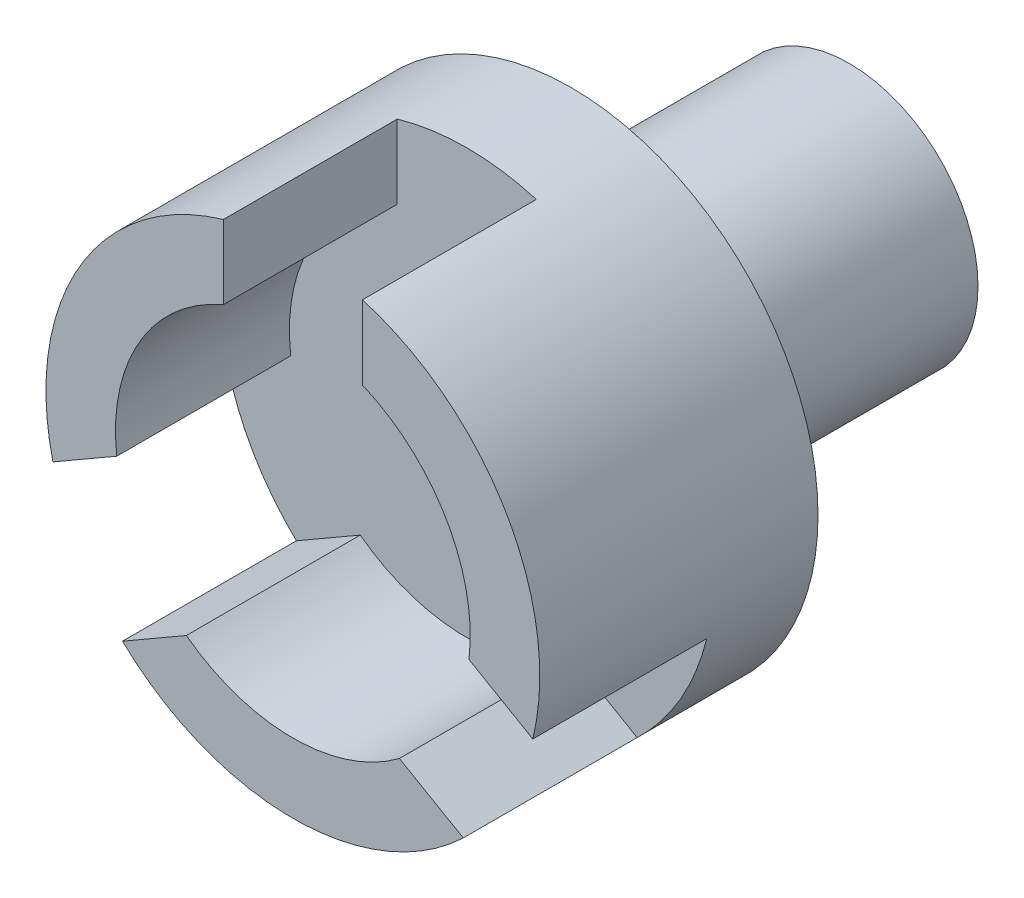
ISO-10303-21;
HEADER;
FILE_DESCRIPTION(('STEP AP214'),'2;1');
FILE_NAME('part.step','',(''),(''),'','','');
FILE_SCHEMA(('AUTOMOTIVE_DESIGN { 1 0 10303 214 1 1 1 1 }'));
ENDSEC;
DATA;
#1=APPLICATION_CONTEXT('core data for automotive mechanical design processes');
#2=APPLICATION_PROTOCOL_DEFINITION('international standard','automotive_design',2000,#1);
#3=PRODUCT_CONTEXT('',#1,'mechanical');
#4=PRODUCT('Part','Part','',(#3));
#5=PRODUCT_RELATED_PRODUCT_CATEGORY('part','',(#4));
#6=PRODUCT_DEFINITION_FORMATION('','',#4);
#7=PRODUCT_DEFINITION_CONTEXT('part definition',#1,'design');
#8=PRODUCT_DEFINITION('design','',#6,#7);
#9=PRODUCT_DEFINITION_SHAPE('','',#8);
#10=(LENGTH_UNIT() NAMED_UNIT(*) SI_UNIT(.MILLI.,.METRE.));
#11=(NAMED_UNIT(*) PLANE_ANGLE_UNIT() SI_UNIT($,.RADIAN.));
#12=(NAMED_UNIT(*) SI_UNIT($,.STERADIAN.) SOLID_ANGLE_UNIT());
#13=UNCERTAINTY_MEASURE_WITH_UNIT(LENGTH_MEASURE(1.E-05),#10,'distance_accuracy_value','');
#14=(GEOMETRIC_REPRESENTATION_CONTEXT(3) GLOBAL_UNCERTAINTY_ASSIGNED_CONTEXT((#13)) GLOBAL_UNIT_ASSIGNED_CONTEXT((#10,
#11,#12)) REPRESENTATION_CONTEXT('',''));
#15=CARTESIAN_POINT('',(0.,0.,0.));
#16=DIRECTION('',(0.,0.,1.));
#17=DIRECTION('',(1.,0.,0.));
#18=AXIS2_PLACEMENT_3D('',#15,#16,#17);
#19=CARTESIAN_POINT('',(-2.76322328200395,3.5645580337851,8.));
#20=DIRECTION('',(0.,0.,-1.));
#21=DIRECTION('',(-1.,0.,0.));
#22=AXIS2_PLACEMENT_3D('',#19,#20,#21);
#23=CYLINDRICAL_SURFACE('',#22,7.1);
#24=CARTESIAN_POINT('',(-2.76322328200395,3.5645580337851,0.));
#25=DIRECTION('',(0.,0.,1.));
#26=DIRECTION('',(1.,0.,0.));
#27=AXIS2_PLACEMENT_3D('',#24,#25,#26);
#28=CIRCLE('',#27,7.1);
#29=CARTESIAN_POINT('',(4.33677671799605,3.5645580337851,0.));
#30=VERTEX_POINT('',#29);
#31=EDGE_CURVE('E257',#30,#30,#28,.T.);
#32=ORIENTED_EDGE('',*,*,#31,.T.);
#33=EDGE_LOOP('',(#32));
#34=FACE_BOUND('',#33,.T.);
#35=DIRECTION('',(0.,0.,1.));
#36=VECTOR('',#35,1.);
#37=CARTESIAN_POINT('',(-4.76322328200395,10.3770465658855,3.));
#38=LINE('',#37,#36);
#39=CARTESIAN_POINT('',(-4.76322328200395,10.3770465658855,3.));
#40=VERTEX_POINT('',#39);
#41=CARTESIAN_POINT('',(-4.76322328200395,10.3770465658855,8.));
#42=VERTEX_POINT('',#41);
#43=EDGE_CURVE('E226',#40,#42,#38,.T.);
#44=ORIENTED_EDGE('',*,*,#43,.F.);
#45=CARTESIAN_POINT('',(-2.76322328200395,3.5645580337851,3.));
#46=DIRECTION('',(0.,0.,1.));
#47=DIRECTION('',(1.,0.,0.));
#48=AXIS2_PLACEMENT_3D('',#45,#46,#47);
#49=CIRCLE('',#48,7.1);
#50=CARTESIAN_POINT('',(-0.763223282003949,10.3770465658855,3.));
#51=VERTEX_POINT('',#50);
#52=EDGE_CURVE('E184',#51,#40,#49,.T.);
#53=ORIENTED_EDGE('',*,*,#52,.F.);
#54=DIRECTION('',(0.,0.,1.));
#55=VECTOR('',#54,1.);
#56=CARTESIAN_POINT('',(-0.763223282003949,10.3770465658855,3.));
#57=LINE('',#56,#55);
#58=CARTESIAN_POINT('',(-0.763223282003949,10.3770465658855,8.));
#59=VERTEX_POINT('',#58);
#60=EDGE_CURVE('E229',#51,#59,#57,.T.);
#61=ORIENTED_EDGE('',*,*,#60,.T.);
#62=CARTESIAN_POINT('',(-2.76322328200395,3.5645580337851,8.));
#63=DIRECTION('',(0.,0.,1.));
#64=DIRECTION('',(1.,0.,0.));
#65=AXIS2_PLACEMENT_3D('',#62,#63,#64);
#66=CIRCLE('',#65,7.1);
#67=CARTESIAN_POINT('',(4.13656484978518,1.89036457530373,8.));
#68=VERTEX_POINT('',#67);
#69=EDGE_CURVE('E252',#68,#59,#66,.T.);
#70=ORIENTED_EDGE('',*,*,#69,.F.);
#71=DIRECTION('',(0.,0.,1.));
#72=VECTOR('',#71,1.);
#73=CARTESIAN_POINT('',(4.13656484978518,1.89036457530373,3.));
#74=LINE('',#73,#72);
#75=CARTESIAN_POINT('',(4.13656484978518,1.89036457530373,3.));
#76=VERTEX_POINT('',#75);
#77=EDGE_CURVE('E172',#76,#68,#74,.T.);
#78=ORIENTED_EDGE('',*,*,#77,.F.);
#79=CARTESIAN_POINT('',(-2.76322328200395,3.5645580337851,3.));
#80=DIRECTION('',(0.,0.,1.));
#81=DIRECTION('',(1.,0.,0.));
#82=AXIS2_PLACEMENT_3D('',#79,#80,#81);
#83=CIRCLE('',#82,7.1);
#84=CARTESIAN_POINT('',(2.13656484978517,-1.57373703983402,3.));
#85=VERTEX_POINT('',#84);
#86=EDGE_CURVE('E155',#85,#76,#83,.T.);
#87=ORIENTED_EDGE('',*,*,#86,.F.);
#88=DIRECTION('',(0.,0.,1.));
#89=VECTOR('',#88,1.);
#90=CARTESIAN_POINT('',(2.13656484978517,-1.57373703983402,3.));
#91=LINE('',#90,#89);
#92=CARTESIAN_POINT('',(2.13656484978517,-1.57373703983402,8.));
#93=VERTEX_POINT('',#92);
#94=EDGE_CURVE('E164',#85,#93,#91,.T.);
#95=ORIENTED_EDGE('',*,*,#94,.T.);
#96=CARTESIAN_POINT('',(-7.66301141379314,-1.57373703983395,8.));
#97=VERTEX_POINT('',#96);
#98=EDGE_CURVE('E256',#97,#93,#66,.T.);
#99=ORIENTED_EDGE('',*,*,#98,.F.);
#100=DIRECTION('',(0.,0.,1.));
#101=VECTOR('',#100,1.);
#102=CARTESIAN_POINT('',(-7.66301141379314,-1.57373703983395,3.));
#103=LINE('',#102,#101);
#104=CARTESIAN_POINT('',(-7.66301141379314,-1.57373703983395,3.));
#105=VERTEX_POINT('',#104);
#106=EDGE_CURVE('E218',#105,#97,#103,.T.);
#107=ORIENTED_EDGE('',*,*,#106,.F.);
#108=CARTESIAN_POINT('',(-2.76322328200395,3.5645580337851,3.));
#109=DIRECTION('',(0.,0.,1.));
#110=DIRECTION('',(1.,0.,0.));
#111=AXIS2_PLACEMENT_3D('',#108,#109,#110);
#112=CIRCLE('',#111,7.1);
#113=CARTESIAN_POINT('',(-9.6630114137931,1.89036457530383,3.));
#114=VERTEX_POINT('',#113);
#115=EDGE_CURVE('E194',#114,#105,#112,.T.);
#116=ORIENTED_EDGE('',*,*,#115,.F.);
#117=DIRECTION('',(0.,0.,1.));
#118=VECTOR('',#117,1.);
#119=CARTESIAN_POINT('',(-9.6630114137931,1.89036457530383,3.));
#120=LINE('',#119,#118);
#121=CARTESIAN_POINT('',(-9.6630114137931,1.89036457530383,8.));
#122=VERTEX_POINT('',#121);
#123=EDGE_CURVE('E222',#114,#122,#120,.T.);
#124=ORIENTED_EDGE('',*,*,#123,.T.);
#125=EDGE_CURVE('E258',#42,#122,#66,.T.);
#126=ORIENTED_EDGE('',*,*,#125,.F.);
#127=EDGE_LOOP('',(#44,#53,#61,#70,#78,#87,#95,#99,#107,#116,#124,#126));
#128=FACE_BOUND('',#127,.T.);
#129=ADVANCED_FACE('F63',(#34,#128),#23,.T.);
#130=CARTESIAN_POINT('',(-2.76322328200395,3.5645580337851,8.));
#131=DIRECTION('',(0.,0.,1.));
#132=DIRECTION('',(1.,0.,0.));
#133=AXIS2_PLACEMENT_3D('',#130,#131,#132);
#134=PLANE('',#133);
#135=DIRECTION('',(0.866025403784436,-0.500000000000004,0.));
#136=VECTOR('',#135,1.);
#137=CARTESIAN_POINT('',(-2.76322328200396,1.2551569570266,8.));
#138=LINE('',#137,#136);
#139=CARTESIAN_POINT('',(0.299719001612672,-0.513233594931769,8.));
#140=VERTEX_POINT('',#139);
#141=EDGE_CURVE('E167',#140,#93,#138,.T.);
#142=ORIENTED_EDGE('',*,*,#141,.F.);
#143=CARTESIAN_POINT('',(-2.76322328200395,3.5645580337851,8.));
#144=DIRECTION('',(0.,0.,1.));
#145=DIRECTION('',(1.,0.,0.));
#146=AXIS2_PLACEMENT_3D('',#143,#144,#145);
#147=CIRCLE('',#146,5.1);
#148=CARTESIAN_POINT('',(-5.82616556562063,-0.513233594931728,8.));
#149=VERTEX_POINT('',#148);
#150=EDGE_CURVE('E251',#149,#140,#147,.T.);
#151=ORIENTED_EDGE('',*,*,#150,.F.);
#152=DIRECTION('',(-0.866025403784443,-0.499999999999992,0.));
#153=VECTOR('',#152,1.);
#154=CARTESIAN_POINT('',(-2.76322328200396,1.2551569570266,8.));
#155=LINE('',#154,#153);
#156=EDGE_CURVE('E161',#149,#97,#155,.T.);
#157=ORIENTED_EDGE('',*,*,#156,.T.);
#158=ORIENTED_EDGE('',*,*,#98,.T.);
#159=EDGE_LOOP('',(#142,#151,#157,#158));
#160=FACE_BOUND('',#159,.T.);
#161=ADVANCED_FACE('F312',(#160),#134,.T.);
#162=DIRECTION('',(-0.866025403784443,-0.499999999999992,0.));
#163=VECTOR('',#162,1.);
#164=CARTESIAN_POINT('',(-4.76322328200395,4.71925857216437,8.));
#165=LINE('',#164,#163);
#166=CARTESIAN_POINT('',(-7.82616556562059,2.95086802020605,8.));
#167=VERTEX_POINT('',#166);
#168=EDGE_CURVE('E212',#167,#122,#165,.T.);
#169=ORIENTED_EDGE('',*,*,#168,.F.);
#170=CARTESIAN_POINT('',(-4.76322328200395,8.25603967608106,8.));
#171=VERTEX_POINT('',#170);
#172=EDGE_CURVE('E246',#171,#167,#147,.T.);
#173=ORIENTED_EDGE('',*,*,#172,.F.);
#174=DIRECTION('',(0.,1.,0.));
#175=VECTOR('',#174,1.);
#176=CARTESIAN_POINT('',(-4.76322328200395,4.71925857216437,8.));
#177=LINE('',#176,#175);
#178=EDGE_CURVE('E208',#171,#42,#177,.T.);
#179=ORIENTED_EDGE('',*,*,#178,.T.);
#180=ORIENTED_EDGE('',*,*,#125,.T.);
#181=EDGE_LOOP('',(#169,#173,#179,#180));
#182=FACE_BOUND('',#181,.T.);
#183=ADVANCED_FACE('F307',(#182),#134,.T.);
#184=CARTESIAN_POINT('',(-2.76322328200395,3.5645580337851,3.));
#185=DIRECTION('',(0.,0.,1.));
#186=DIRECTION('',(1.,0.,0.));
#187=AXIS2_PLACEMENT_3D('',#184,#185,#186);
#188=CYLINDRICAL_SURFACE('',#187,5.1);
#189=ORIENTED_EDGE('',*,*,#150,.T.);
#190=DIRECTION('',(0.,0.,1.));
#191=VECTOR('',#190,1.);
#192=CARTESIAN_POINT('',(0.299719001612672,-0.513233594931769,3.));
#193=LINE('',#192,#191);
#194=CARTESIAN_POINT('',(0.299719001612672,-0.513233594931769,3.));
#195=VERTEX_POINT('',#194);
#196=EDGE_CURVE('E12',#140,#195,#193,.F.);
#197=ORIENTED_EDGE('',*,*,#196,.T.);
#198=CARTESIAN_POINT('',(-2.76322328200395,3.5645580337851,3.));
#199=DIRECTION('',(0.,0.,1.));
#200=DIRECTION('',(1.,0.,0.));
#201=AXIS2_PLACEMENT_3D('',#198,#199,#200);
#202=CIRCLE('',#201,5.1);
#203=CARTESIAN_POINT('',(-5.82616556562062,-0.513233594931727,3.));
#204=VERTEX_POINT('',#203);
#205=EDGE_CURVE('E158',#204,#195,#202,.T.);
#206=ORIENTED_EDGE('',*,*,#205,.F.);
#207=DIRECTION('',(0.,0.,1.));
#208=VECTOR('',#207,1.);
#209=CARTESIAN_POINT('',(-5.82616556562063,-0.513233594931727,3.));
#210=LINE('',#209,#208);
#211=EDGE_CURVE('E71',#149,#204,#210,.F.);
#212=ORIENTED_EDGE('',*,*,#211,.F.);
#213=EDGE_LOOP('',(#189,#197,#206,#212));
#214=FACE_BOUND('',#213,.T.);
#215=ADVANCED_FACE('F291',(#214),#188,.F.);
#216=ORIENTED_EDGE('',*,*,#172,.T.);
#217=DIRECTION('',(0.,0.,1.));
#218=VECTOR('',#217,1.);
#219=CARTESIAN_POINT('',(-7.82616556562059,2.95086802020605,3.));
#220=LINE('',#219,#218);
#221=CARTESIAN_POINT('',(-7.82616556562059,2.95086802020605,3.));
#222=VERTEX_POINT('',#221);
#223=EDGE_CURVE('E281',#167,#222,#220,.F.);
#224=ORIENTED_EDGE('',*,*,#223,.T.);
#225=CARTESIAN_POINT('',(-4.76322328200395,8.25603967608106,3.));
#226=VERTEX_POINT('',#225);
#227=EDGE_CURVE('E247',#226,#222,#202,.T.);
#228=ORIENTED_EDGE('',*,*,#227,.F.);
#229=DIRECTION('',(0.,0.,1.));
#230=VECTOR('',#229,1.);
#231=CARTESIAN_POINT('',(-4.76322328200395,8.25603967608106,3.));
#232=LINE('',#231,#230);
#233=EDGE_CURVE('E277',#171,#226,#232,.F.);
#234=ORIENTED_EDGE('',*,*,#233,.F.);
#235=EDGE_LOOP('',(#216,#224,#228,#234));
#236=FACE_BOUND('',#235,.T.);
#237=ADVANCED_FACE('F300',(#236),#188,.F.);
#238=CARTESIAN_POINT('',(-2.76322328200395,3.5645580337851,6.));
#239=DIRECTION('',(0.,0.,-1.));
#240=DIRECTION('',(-1.,0.,0.));
#241=AXIS2_PLACEMENT_3D('',#238,#239,#240);
#242=CYLINDRICAL_SURFACE('',#241,1.7);
#243=CARTESIAN_POINT('',(-2.76322328200395,3.5645580337851,3.));
#244=DIRECTION('',(0.,0.,1.));
#245=DIRECTION('',(1.,0.,0.));
#246=AXIS2_PLACEMENT_3D('',#243,#244,#245);
#247=CIRCLE('',#246,1.7);
#248=CARTESIAN_POINT('',(-1.06322328200395,3.5645580337851,3.));
#249=VERTEX_POINT('',#248);
#250=EDGE_CURVE('E262',#249,#249,#247,.F.);
#251=ORIENTED_EDGE('',*,*,#250,.F.);
#252=EDGE_LOOP('',(#251));
#253=FACE_BOUND('',#252,.T.);
#254=CARTESIAN_POINT('',(-2.76322328200395,3.5645580337851,-8.));
#255=DIRECTION('',(0.,0.,-1.));
#256=DIRECTION('',(-1.,0.,0.));
#257=AXIS2_PLACEMENT_3D('',#254,#255,#256);
#258=CIRCLE('',#257,1.7);
#259=CARTESIAN_POINT('',(-4.46322328200395,3.5645580337851,-8.));
#260=VERTEX_POINT('',#259);
#261=EDGE_CURVE('E221',#260,#260,#258,.F.);
#262=ORIENTED_EDGE('',*,*,#261,.F.);
#263=EDGE_LOOP('',(#262));
#264=FACE_BOUND('',#263,.T.);
#265=ADVANCED_FACE('F328',(#253,#264),#242,.F.);
#266=DIRECTION('',(0.,1.,0.));
#267=VECTOR('',#266,1.);
#268=CARTESIAN_POINT('',(-0.763223282003948,4.71925857216435,8.));
#269=LINE('',#268,#267);
#270=CARTESIAN_POINT('',(-0.763223282003948,8.25603967608106,8.));
#271=VERTEX_POINT('',#270);
#272=EDGE_CURVE('E205',#271,#59,#269,.T.);
#273=ORIENTED_EDGE('',*,*,#272,.F.);
#274=CARTESIAN_POINT('',(2.29971900161269,2.95086802020598,8.));
#275=VERTEX_POINT('',#274);
#276=EDGE_CURVE('E242',#275,#271,#147,.T.);
#277=ORIENTED_EDGE('',*,*,#276,.F.);
#278=DIRECTION('',(0.866025403784436,-0.500000000000004,0.));
#279=VECTOR('',#278,1.);
#280=CARTESIAN_POINT('',(-0.763223282003948,4.71925857216435,8.));
#281=LINE('',#280,#279);
#282=EDGE_CURVE('E201',#275,#68,#281,.T.);
#283=ORIENTED_EDGE('',*,*,#282,.T.);
#284=ORIENTED_EDGE('',*,*,#69,.T.);
#285=EDGE_LOOP('',(#273,#277,#283,#284));
#286=FACE_BOUND('',#285,.T.);
#287=ADVANCED_FACE('F319',(#286),#134,.T.);
#288=CARTESIAN_POINT('',(-2.76322328200395,3.5645580337851,0.));
#289=DIRECTION('',(0.,0.,1.));
#290=DIRECTION('',(1.,0.,0.));
#291=AXIS2_PLACEMENT_3D('',#288,#289,#290);
#292=PLANE('',#291);
#293=CARTESIAN_POINT('',(-2.76322328200395,3.5645580337851,0.));
#294=DIRECTION('',(0.,0.,1.));
#295=DIRECTION('',(1.,0.,0.));
#296=AXIS2_PLACEMENT_3D('',#293,#294,#295);
#297=CIRCLE('',#296,3.7);
#298=CARTESIAN_POINT('',(0.936776717996052,3.5645580337851,0.));
#299=VERTEX_POINT('',#298);
#300=EDGE_CURVE('E266',#299,#299,#297,.F.);
#301=ORIENTED_EDGE('',*,*,#300,.F.);
#302=EDGE_LOOP('',(#301));
#303=FACE_BOUND('',#302,.T.);
#304=ORIENTED_EDGE('',*,*,#31,.F.);
#305=EDGE_LOOP('',(#304));
#306=FACE_BOUND('',#305,.T.);
#307=ADVANCED_FACE('F327',(#303,#306),#292,.F.);
#308=CARTESIAN_POINT('',(-2.76322328200395,3.5645580337851,3.));
#309=DIRECTION('',(0.,0.,1.));
#310=DIRECTION('',(1.,0.,0.));
#311=AXIS2_PLACEMENT_3D('',#308,#309,#310);
#312=PLANE('',#311);
#313=ORIENTED_EDGE('',*,*,#205,.T.);
#314=DIRECTION('',(0.866025403784436,-0.500000000000004,0.));
#315=VECTOR('',#314,1.);
#316=CARTESIAN_POINT('',(-2.76322328200396,1.2551569570266,3.));
#317=LINE('',#316,#315);
#318=EDGE_CURVE('E150',#195,#85,#317,.T.);
#319=ORIENTED_EDGE('',*,*,#318,.T.);
#320=ORIENTED_EDGE('',*,*,#86,.T.);
#321=DIRECTION('',(0.866025403784436,-0.500000000000004,0.));
#322=VECTOR('',#321,1.);
#323=CARTESIAN_POINT('',(-0.763223282003948,4.71925857216435,3.));
#324=LINE('',#323,#322);
#325=CARTESIAN_POINT('',(2.29971900161269,2.95086802020598,3.));
#326=VERTEX_POINT('',#325);
#327=EDGE_CURVE('E78',#326,#76,#324,.T.);
#328=ORIENTED_EDGE('',*,*,#327,.F.);
#329=CARTESIAN_POINT('',(-0.763223282003948,8.25603967608106,3.));
#330=VERTEX_POINT('',#329);
#331=EDGE_CURVE('E243',#326,#330,#202,.T.);
#332=ORIENTED_EDGE('',*,*,#331,.T.);
#333=DIRECTION('',(0.,1.,0.));
#334=VECTOR('',#333,1.);
#335=CARTESIAN_POINT('',(-0.763223282003948,4.71925857216435,3.));
#336=LINE('',#335,#334);
#337=EDGE_CURVE('E179',#330,#51,#336,.T.);
#338=ORIENTED_EDGE('',*,*,#337,.T.);
#339=ORIENTED_EDGE('',*,*,#52,.T.);
#340=DIRECTION('',(0.,1.,0.));
#341=VECTOR('',#340,1.);
#342=CARTESIAN_POINT('',(-4.76322328200395,4.71925857216437,3.));
#343=LINE('',#342,#341);
#344=EDGE_CURVE('E188',#226,#40,#343,.T.);
#345=ORIENTED_EDGE('',*,*,#344,.F.);
#346=ORIENTED_EDGE('',*,*,#227,.T.);
#347=DIRECTION('',(-0.866025403784443,-0.499999999999992,0.));
#348=VECTOR('',#347,1.);
#349=CARTESIAN_POINT('',(-4.76322328200395,4.71925857216437,3.));
#350=LINE('',#349,#348);
#351=EDGE_CURVE('E191',#222,#114,#350,.T.);
#352=ORIENTED_EDGE('',*,*,#351,.T.);
#353=ORIENTED_EDGE('',*,*,#115,.T.);
#354=DIRECTION('',(-0.866025403784443,-0.499999999999992,0.));
#355=VECTOR('',#354,1.);
#356=CARTESIAN_POINT('',(-2.76322328200396,1.2551569570266,3.));
#357=LINE('',#356,#355);
#358=EDGE_CURVE('E85',#204,#105,#357,.T.);
#359=ORIENTED_EDGE('',*,*,#358,.F.);
#360=EDGE_LOOP('',(#313,#319,#320,#328,#332,#338,#339,#345,#346,#352,#353,#359));
#361=FACE_BOUND('',#360,.T.);
#362=ORIENTED_EDGE('',*,*,#250,.T.);
#363=EDGE_LOOP('',(#362));
#364=FACE_BOUND('',#363,.T.);
#365=ADVANCED_FACE('F152',(#361,#364),#312,.T.);
#366=ORIENTED_EDGE('',*,*,#276,.T.);
#367=DIRECTION('',(0.,0.,1.));
#368=VECTOR('',#367,1.);
#369=CARTESIAN_POINT('',(-0.763223282003948,8.25603967608106,3.));
#370=LINE('',#369,#368);
#371=EDGE_CURVE('E273',#271,#330,#370,.F.);
#372=ORIENTED_EDGE('',*,*,#371,.T.);
#373=ORIENTED_EDGE('',*,*,#331,.F.);
#374=DIRECTION('',(0.,0.,1.));
#375=VECTOR('',#374,1.);
#376=CARTESIAN_POINT('',(2.29971900161269,2.95086802020598,3.));
#377=LINE('',#376,#375);
#378=EDGE_CURVE('E270',#275,#326,#377,.F.);
#379=ORIENTED_EDGE('',*,*,#378,.F.);
#380=EDGE_LOOP('',(#366,#372,#373,#379));
#381=FACE_BOUND('',#380,.T.);
#382=ADVANCED_FACE('F342',(#381),#188,.F.);
#383=CARTESIAN_POINT('',(-2.76322328200395,3.5645580337851,-8.));
#384=DIRECTION('',(0.,0.,1.));
#385=DIRECTION('',(1.,0.,0.));
#386=AXIS2_PLACEMENT_3D('',#383,#384,#385);
#387=CYLINDRICAL_SURFACE('',#386,3.7);
#388=CARTESIAN_POINT('',(-2.76322328200395,3.5645580337851,-8.));
#389=DIRECTION('',(0.,0.,-1.));
#390=DIRECTION('',(-1.,0.,0.));
#391=AXIS2_PLACEMENT_3D('',#388,#389,#390);
#392=CIRCLE('',#391,3.7);
#393=CARTESIAN_POINT('',(-6.46322328200395,3.5645580337851,-8.));
#394=VERTEX_POINT('',#393);
#395=EDGE_CURVE('E238',#394,#394,#392,.T.);
#396=ORIENTED_EDGE('',*,*,#395,.F.);
#397=EDGE_LOOP('',(#396));
#398=FACE_BOUND('',#397,.T.);
#399=ORIENTED_EDGE('',*,*,#300,.T.);
#400=EDGE_LOOP('',(#399));
#401=FACE_BOUND('',#400,.T.);
#402=ADVANCED_FACE('F367',(#398,#401),#387,.T.);
#403=CARTESIAN_POINT('',(0.,0.,-8.));
#404=DIRECTION('',(0.,0.,-1.));
#405=DIRECTION('',(-1.,0.,0.));
#406=AXIS2_PLACEMENT_3D('',#403,#404,#405);
#407=PLANE('',#406);
#408=ORIENTED_EDGE('',*,*,#261,.T.);
#409=EDGE_LOOP('',(#408));
#410=FACE_BOUND('',#409,.T.);
#411=ORIENTED_EDGE('',*,*,#395,.T.);
#412=EDGE_LOOP('',(#411));
#413=FACE_BOUND('',#412,.T.);
#414=ADVANCED_FACE('F357',(#410,#413),#407,.T.);
#415=CARTESIAN_POINT('',(-0.763223282003948,4.71925857216435,3.));
#416=DIRECTION('',(1.,0.,0.));
#417=DIRECTION('',(0.,1.,0.));
#418=AXIS2_PLACEMENT_3D('',#415,#416,#417);
#419=PLANE('',#418);
#420=ORIENTED_EDGE('',*,*,#272,.T.);
#421=ORIENTED_EDGE('',*,*,#60,.F.);
#422=ORIENTED_EDGE('',*,*,#337,.F.);
#423=ORIENTED_EDGE('',*,*,#371,.F.);
#424=EDGE_LOOP('',(#420,#421,#422,#423));
#425=FACE_BOUND('',#424,.T.);
#426=ADVANCED_FACE('F347',(#425),#419,.F.);
#427=CARTESIAN_POINT('',(-4.76322328200395,4.71925857216437,3.));
#428=DIRECTION('',(1.,0.,0.));
#429=DIRECTION('',(0.,0.,-1.));
#430=AXIS2_PLACEMENT_3D('',#427,#428,#429);
#431=PLANE('',#430);
#432=ORIENTED_EDGE('',*,*,#233,.T.);
#433=ORIENTED_EDGE('',*,*,#344,.T.);
#434=ORIENTED_EDGE('',*,*,#43,.T.);
#435=ORIENTED_EDGE('',*,*,#178,.F.);
#436=EDGE_LOOP('',(#432,#433,#434,#435));
#437=FACE_BOUND('',#436,.T.);
#438=ADVANCED_FACE('F349',(#437),#431,.T.);
#439=CARTESIAN_POINT('',(-4.76322328200395,4.71925857216437,3.));
#440=DIRECTION('',(-0.499999999999992,0.866025403784443,0.));
#441=DIRECTION('',(-0.866025403784443,-0.499999999999992,0.));
#442=AXIS2_PLACEMENT_3D('',#439,#440,#441);
#443=PLANE('',#442);
#444=ORIENTED_EDGE('',*,*,#168,.T.);
#445=ORIENTED_EDGE('',*,*,#123,.F.);
#446=ORIENTED_EDGE('',*,*,#351,.F.);
#447=ORIENTED_EDGE('',*,*,#223,.F.);
#448=EDGE_LOOP('',(#444,#445,#446,#447));
#449=FACE_BOUND('',#448,.T.);
#450=ADVANCED_FACE('F304',(#449),#443,.F.);
#451=CARTESIAN_POINT('',(-2.76322328200396,1.2551569570266,3.));
#452=DIRECTION('',(-0.499999999999992,0.866025403784443,0.));
#453=DIRECTION('',(-0.866025403784443,-0.499999999999992,0.));
#454=AXIS2_PLACEMENT_3D('',#451,#452,#453);
#455=PLANE('',#454);
#456=ORIENTED_EDGE('',*,*,#211,.T.);
#457=ORIENTED_EDGE('',*,*,#358,.T.);
#458=ORIENTED_EDGE('',*,*,#106,.T.);
#459=ORIENTED_EDGE('',*,*,#156,.F.);
#460=EDGE_LOOP('',(#456,#457,#458,#459));
#461=FACE_BOUND('',#460,.T.);
#462=ADVANCED_FACE('F287',(#461),#455,.T.);
#463=CARTESIAN_POINT('',(-2.76322328200396,1.2551569570266,3.));
#464=DIRECTION('',(-0.500000000000004,-0.866025403784436,0.));
#465=DIRECTION('',(0.866025403784436,-0.500000000000004,0.));
#466=AXIS2_PLACEMENT_3D('',#463,#464,#465);
#467=PLANE('',#466);
#468=ORIENTED_EDGE('',*,*,#141,.T.);
#469=ORIENTED_EDGE('',*,*,#94,.F.);
#470=ORIENTED_EDGE('',*,*,#318,.F.);
#471=ORIENTED_EDGE('',*,*,#196,.F.);
#472=EDGE_LOOP('',(#468,#469,#470,#471));
#473=FACE_BOUND('',#472,.T.);
#474=ADVANCED_FACE('F165',(#473),#467,.F.);
#475=CARTESIAN_POINT('',(-0.763223282003948,4.71925857216435,3.));
#476=DIRECTION('',(-0.500000000000004,-0.866025403784436,0.));
#477=DIRECTION('',(0.866025403784436,-0.500000000000004,0.));
#478=AXIS2_PLACEMENT_3D('',#475,#476,#477);
#479=PLANE('',#478);
#480=ORIENTED_EDGE('',*,*,#378,.T.);
#481=ORIENTED_EDGE('',*,*,#327,.T.);
#482=ORIENTED_EDGE('',*,*,#77,.T.);
#483=ORIENTED_EDGE('',*,*,#282,.F.);
#484=EDGE_LOOP('',(#480,#481,#482,#483));
#485=FACE_BOUND('',#484,.T.);
#486=ADVANCED_FACE('F345',(#485),#479,.T.);
#487=CLOSED_SHELL('',(#129,#161,#183,#215,#237,#265,#287,#307,#365,#382,#402,#414,#426,#438,
#450,#462,#474,#486));
#488=MANIFOLD_SOLID_BREP('B2',#487);
#489=ADVANCED_BREP_SHAPE_REPRESENTATION('',(#18,#488),#14);
#490=SHAPE_DEFINITION_REPRESENTATION(#9,#489);
ENDSEC;
END-ISO-10303-21;
